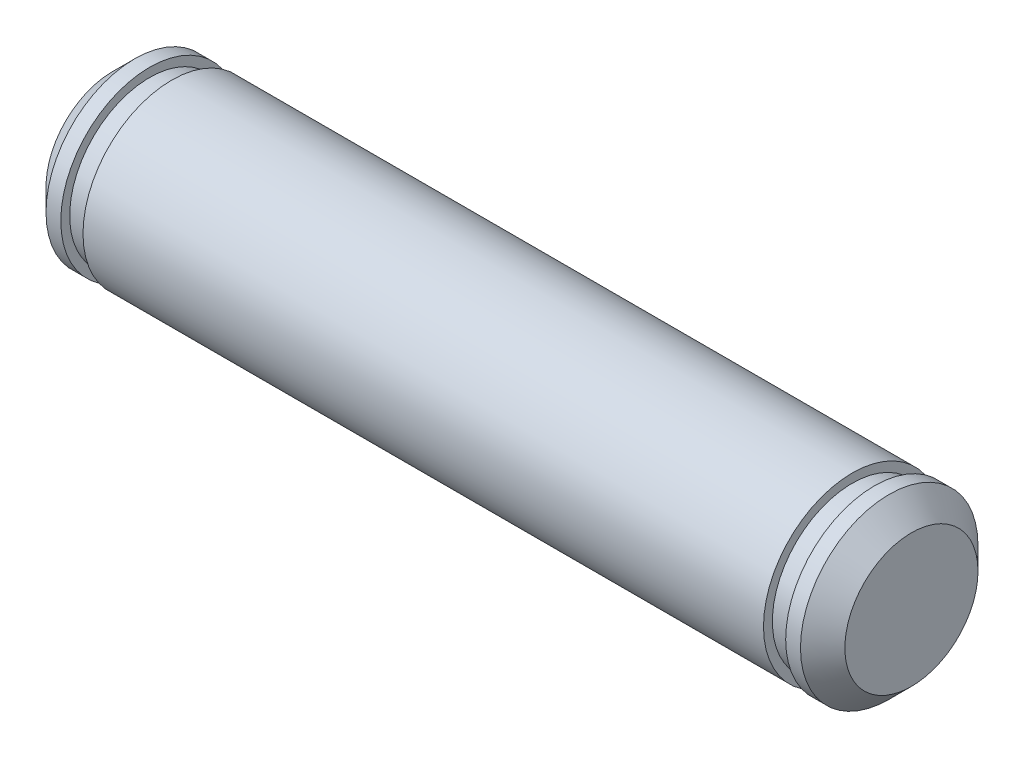
ISO-10303-21;
HEADER;
FILE_DESCRIPTION(('STEP AP214'),'2;1');
FILE_NAME('part.step','',(''),(''),'','','');
FILE_SCHEMA(('AUTOMOTIVE_DESIGN { 1 0 10303 214 1 1 1 1 }'));
ENDSEC;
DATA;
#1=APPLICATION_CONTEXT('core data for automotive mechanical design processes');
#2=APPLICATION_PROTOCOL_DEFINITION('international standard','automotive_design',2000,#1);
#3=PRODUCT_CONTEXT('',#1,'mechanical');
#4=PRODUCT('Part','Part','',(#3));
#5=PRODUCT_RELATED_PRODUCT_CATEGORY('part','',(#4));
#6=PRODUCT_DEFINITION_FORMATION('','',#4);
#7=PRODUCT_DEFINITION_CONTEXT('part definition',#1,'design');
#8=PRODUCT_DEFINITION('design','',#6,#7);
#9=PRODUCT_DEFINITION_SHAPE('','',#8);
#10=(LENGTH_UNIT() NAMED_UNIT(*) SI_UNIT(.MILLI.,.METRE.));
#11=(NAMED_UNIT(*) PLANE_ANGLE_UNIT() SI_UNIT($,.RADIAN.));
#12=(NAMED_UNIT(*) SI_UNIT($,.STERADIAN.) SOLID_ANGLE_UNIT());
#13=UNCERTAINTY_MEASURE_WITH_UNIT(LENGTH_MEASURE(1.E-05),#10,'distance_accuracy_value','');
#14=(GEOMETRIC_REPRESENTATION_CONTEXT(3) GLOBAL_UNCERTAINTY_ASSIGNED_CONTEXT((#13)) GLOBAL_UNIT_ASSIGNED_CONTEXT((#10,
#11,#12)) REPRESENTATION_CONTEXT('',''));
#15=CARTESIAN_POINT('',(0.,0.,0.));
#16=DIRECTION('',(0.,0.,1.));
#17=DIRECTION('',(1.,0.,0.));
#18=AXIS2_PLACEMENT_3D('',#15,#16,#17);
#19=CARTESIAN_POINT('',(13.5,0.,0.));
#20=DIRECTION('',(-1.,0.,0.));
#21=DIRECTION('',(0.,0.,1.));
#22=AXIS2_PLACEMENT_3D('',#19,#20,#21);
#23=CYLINDRICAL_SURFACE('',#22,3.);
#24=CARTESIAN_POINT('',(-11.5,0.,0.));
#25=DIRECTION('',(1.,0.,0.));
#26=DIRECTION('',(0.,0.,-1.));
#27=AXIS2_PLACEMENT_3D('',#24,#25,#26);
#28=CIRCLE('',#27,3.);
#29=CARTESIAN_POINT('',(-11.5,0.,-3.));
#30=VERTEX_POINT('',#29);
#31=EDGE_CURVE('E49',#30,#30,#28,.T.);
#32=ORIENTED_EDGE('',*,*,#31,.T.);
#33=EDGE_LOOP('',(#32));
#34=FACE_BOUND('',#33,.T.);
#35=CARTESIAN_POINT('',(11.5,0.,0.));
#36=DIRECTION('',(1.,0.,0.));
#37=DIRECTION('',(0.,0.,-1.));
#38=AXIS2_PLACEMENT_3D('',#35,#36,#37);
#39=CIRCLE('',#38,3.);
#40=CARTESIAN_POINT('',(11.5,0.,-3.));
#41=VERTEX_POINT('',#40);
#42=EDGE_CURVE('E48',#41,#41,#39,.T.);
#43=ORIENTED_EDGE('',*,*,#42,.F.);
#44=EDGE_LOOP('',(#43));
#45=FACE_BOUND('',#44,.T.);
#46=ADVANCED_FACE('F28',(#34,#45),#23,.T.);
#47=CARTESIAN_POINT('',(11.5,0.,0.));
#48=DIRECTION('',(1.,0.,0.));
#49=DIRECTION('',(0.,0.,-1.));
#50=AXIS2_PLACEMENT_3D('',#47,#48,#49);
#51=PLANE('',#50);
#52=CARTESIAN_POINT('',(11.5,0.,0.));
#53=DIRECTION('',(1.,0.,0.));
#54=DIRECTION('',(0.,0.,-1.));
#55=AXIS2_PLACEMENT_3D('',#52,#53,#54);
#56=CIRCLE('',#55,2.7);
#57=CARTESIAN_POINT('',(11.5,0.,-2.7));
#58=VERTEX_POINT('',#57);
#59=EDGE_CURVE('E62',#58,#58,#56,.T.);
#60=ORIENTED_EDGE('',*,*,#59,.F.);
#61=EDGE_LOOP('',(#60));
#62=FACE_BOUND('',#61,.T.);
#63=ORIENTED_EDGE('',*,*,#42,.T.);
#64=EDGE_LOOP('',(#63));
#65=FACE_BOUND('',#64,.T.);
#66=ADVANCED_FACE('F97',(#62,#65),#51,.T.);
#67=CARTESIAN_POINT('',(12.25,0.,0.));
#68=DIRECTION('',(1.,0.,0.));
#69=DIRECTION('',(0.,0.,-1.));
#70=AXIS2_PLACEMENT_3D('',#67,#68,#69);
#71=PLANE('',#70);
#72=CARTESIAN_POINT('',(12.25,0.,0.));
#73=DIRECTION('',(1.,0.,0.));
#74=DIRECTION('',(0.,0.,-1.));
#75=AXIS2_PLACEMENT_3D('',#72,#73,#74);
#76=CIRCLE('',#75,2.7);
#77=CARTESIAN_POINT('',(12.25,0.,-2.7));
#78=VERTEX_POINT('',#77);
#79=EDGE_CURVE('E52',#78,#78,#76,.T.);
#80=ORIENTED_EDGE('',*,*,#79,.T.);
#81=EDGE_LOOP('',(#80));
#82=FACE_BOUND('',#81,.T.);
#83=CARTESIAN_POINT('',(12.25,0.,0.));
#84=DIRECTION('',(1.,0.,0.));
#85=DIRECTION('',(0.,0.,-1.));
#86=AXIS2_PLACEMENT_3D('',#83,#84,#85);
#87=CIRCLE('',#86,3.);
#88=CARTESIAN_POINT('',(12.25,0.,-3.));
#89=VERTEX_POINT('',#88);
#90=EDGE_CURVE('E59',#89,#89,#87,.T.);
#91=ORIENTED_EDGE('',*,*,#90,.F.);
#92=EDGE_LOOP('',(#91));
#93=FACE_BOUND('',#92,.T.);
#94=ADVANCED_FACE('F111',(#82,#93),#71,.F.);
#95=CARTESIAN_POINT('',(11.5,0.,0.));
#96=DIRECTION('',(1.,0.,0.));
#97=DIRECTION('',(0.,0.,-1.));
#98=AXIS2_PLACEMENT_3D('',#95,#96,#97);
#99=CYLINDRICAL_SURFACE('',#98,2.7);
#100=ORIENTED_EDGE('',*,*,#59,.T.);
#101=EDGE_LOOP('',(#100));
#102=FACE_BOUND('',#101,.T.);
#103=ORIENTED_EDGE('',*,*,#79,.F.);
#104=EDGE_LOOP('',(#103));
#105=FACE_BOUND('',#104,.T.);
#106=ADVANCED_FACE('F107',(#102,#105),#99,.T.);
#107=CARTESIAN_POINT('',(13.5,0.,0.));
#108=DIRECTION('',(1.,0.,0.));
#109=DIRECTION('',(0.,0.,-1.));
#110=AXIS2_PLACEMENT_3D('',#107,#108,#109);
#111=PLANE('',#110);
#112=CARTESIAN_POINT('',(13.5,0.,0.));
#113=DIRECTION('',(1.,0.,0.));
#114=DIRECTION('',(0.,0.,-1.));
#115=AXIS2_PLACEMENT_3D('',#112,#113,#114);
#116=CIRCLE('',#115,2.24999999999999);
#117=CARTESIAN_POINT('',(13.5,0.,-2.24999999999999));
#118=VERTEX_POINT('',#117);
#119=EDGE_CURVE('E35',#118,#118,#116,.T.);
#120=ORIENTED_EDGE('',*,*,#119,.T.);
#121=EDGE_LOOP('',(#120));
#122=FACE_BOUND('',#121,.T.);
#123=ADVANCED_FACE('F100',(#122),#111,.T.);
#124=CARTESIAN_POINT('',(12.75,0.,0.));
#125=DIRECTION('',(1.,0.,0.));
#126=DIRECTION('',(0.,0.,-1.));
#127=AXIS2_PLACEMENT_3D('',#124,#125,#126);
#128=CIRCLE('',#127,3.);
#129=CARTESIAN_POINT('',(12.75,0.,-3.));
#130=VERTEX_POINT('',#129);
#131=EDGE_CURVE('E10',#130,#130,#128,.F.);
#132=ORIENTED_EDGE('',*,*,#131,.T.);
#133=EDGE_LOOP('',(#132));
#134=FACE_BOUND('',#133,.T.);
#135=ORIENTED_EDGE('',*,*,#90,.T.);
#136=EDGE_LOOP('',(#135));
#137=FACE_BOUND('',#136,.T.);
#138=ADVANCED_FACE('F30',(#134,#137),#23,.T.);
#139=CARTESIAN_POINT('',(-11.5,0.,0.));
#140=DIRECTION('',(1.,0.,0.));
#141=DIRECTION('',(0.,0.,-1.));
#142=AXIS2_PLACEMENT_3D('',#139,#140,#141);
#143=PLANE('',#142);
#144=CARTESIAN_POINT('',(-11.5,0.,0.));
#145=DIRECTION('',(1.,0.,0.));
#146=DIRECTION('',(0.,0.,-1.));
#147=AXIS2_PLACEMENT_3D('',#144,#145,#146);
#148=CIRCLE('',#147,2.7);
#149=CARTESIAN_POINT('',(-11.5,0.,-2.7));
#150=VERTEX_POINT('',#149);
#151=EDGE_CURVE('E56',#150,#150,#148,.T.);
#152=ORIENTED_EDGE('',*,*,#151,.T.);
#153=EDGE_LOOP('',(#152));
#154=FACE_BOUND('',#153,.T.);
#155=ORIENTED_EDGE('',*,*,#31,.F.);
#156=EDGE_LOOP('',(#155));
#157=FACE_BOUND('',#156,.T.);
#158=ADVANCED_FACE('F78',(#154,#157),#143,.F.);
#159=CARTESIAN_POINT('',(-12.25,0.,0.));
#160=DIRECTION('',(1.,0.,0.));
#161=DIRECTION('',(0.,0.,-1.));
#162=AXIS2_PLACEMENT_3D('',#159,#160,#161);
#163=PLANE('',#162);
#164=CARTESIAN_POINT('',(-12.25,0.,0.));
#165=DIRECTION('',(1.,0.,0.));
#166=DIRECTION('',(0.,0.,-1.));
#167=AXIS2_PLACEMENT_3D('',#164,#165,#166);
#168=CIRCLE('',#167,2.7);
#169=CARTESIAN_POINT('',(-12.25,0.,-2.7));
#170=VERTEX_POINT('',#169);
#171=EDGE_CURVE('E69',#170,#170,#168,.T.);
#172=ORIENTED_EDGE('',*,*,#171,.F.);
#173=EDGE_LOOP('',(#172));
#174=FACE_BOUND('',#173,.T.);
#175=CARTESIAN_POINT('',(-12.25,0.,0.));
#176=DIRECTION('',(1.,0.,0.));
#177=DIRECTION('',(0.,0.,-1.));
#178=AXIS2_PLACEMENT_3D('',#175,#176,#177);
#179=CIRCLE('',#178,3.);
#180=CARTESIAN_POINT('',(-12.25,0.,-3.));
#181=VERTEX_POINT('',#180);
#182=EDGE_CURVE('E53',#181,#181,#179,.T.);
#183=ORIENTED_EDGE('',*,*,#182,.T.);
#184=EDGE_LOOP('',(#183));
#185=FACE_BOUND('',#184,.T.);
#186=ADVANCED_FACE('F75',(#174,#185),#163,.T.);
#187=CARTESIAN_POINT('',(-11.5,0.,0.));
#188=DIRECTION('',(-1.,0.,0.));
#189=DIRECTION('',(0.,0.,1.));
#190=AXIS2_PLACEMENT_3D('',#187,#188,#189);
#191=CYLINDRICAL_SURFACE('',#190,2.7);
#192=ORIENTED_EDGE('',*,*,#151,.F.);
#193=EDGE_LOOP('',(#192));
#194=FACE_BOUND('',#193,.T.);
#195=ORIENTED_EDGE('',*,*,#171,.T.);
#196=EDGE_LOOP('',(#195));
#197=FACE_BOUND('',#196,.T.);
#198=ADVANCED_FACE('F73',(#194,#197),#191,.T.);
#199=CARTESIAN_POINT('',(-13.5,0.,0.));
#200=DIRECTION('',(1.,0.,0.));
#201=DIRECTION('',(0.,0.,-1.));
#202=AXIS2_PLACEMENT_3D('',#199,#200,#201);
#203=PLANE('',#202);
#204=CARTESIAN_POINT('',(-13.5,0.,0.));
#205=DIRECTION('',(1.,0.,0.));
#206=DIRECTION('',(0.,0.,-1.));
#207=AXIS2_PLACEMENT_3D('',#204,#205,#206);
#208=CIRCLE('',#207,2.24999999999999);
#209=CARTESIAN_POINT('',(-13.5,0.,-2.24999999999999));
#210=VERTEX_POINT('',#209);
#211=EDGE_CURVE('E39',#210,#210,#208,.F.);
#212=ORIENTED_EDGE('',*,*,#211,.T.);
#213=EDGE_LOOP('',(#212));
#214=FACE_BOUND('',#213,.T.);
#215=ADVANCED_FACE('F85',(#214),#203,.F.);
#216=CARTESIAN_POINT('',(-12.75,0.,0.));
#217=DIRECTION('',(1.,0.,0.));
#218=DIRECTION('',(0.,0.,-1.));
#219=AXIS2_PLACEMENT_3D('',#216,#217,#218);
#220=CIRCLE('',#219,3.);
#221=CARTESIAN_POINT('',(-12.75,0.,-3.));
#222=VERTEX_POINT('',#221);
#223=EDGE_CURVE('E43',#222,#222,#220,.T.);
#224=ORIENTED_EDGE('',*,*,#223,.T.);
#225=EDGE_LOOP('',(#224));
#226=FACE_BOUND('',#225,.T.);
#227=ORIENTED_EDGE('',*,*,#182,.F.);
#228=EDGE_LOOP('',(#227));
#229=FACE_BOUND('',#228,.T.);
#230=ADVANCED_FACE('F82',(#226,#229),#23,.T.);
#231=CARTESIAN_POINT('',(-12.75,0.,0.));
#232=DIRECTION('',(1.,0.,0.));
#233=DIRECTION('',(0.,0.,-1.));
#234=AXIS2_PLACEMENT_3D('',#231,#232,#233);
#235=CONICAL_SURFACE('',#234,3.,0.785398163397445);
#236=ORIENTED_EDGE('',*,*,#211,.F.);
#237=EDGE_LOOP('',(#236));
#238=FACE_BOUND('',#237,.T.);
#239=ORIENTED_EDGE('',*,*,#223,.F.);
#240=EDGE_LOOP('',(#239));
#241=FACE_BOUND('',#240,.T.);
#242=ADVANCED_FACE('F84',(#238,#241),#235,.T.);
#243=CARTESIAN_POINT('',(13.5,0.,0.));
#244=DIRECTION('',(-1.,0.,0.));
#245=DIRECTION('',(0.,0.,1.));
#246=AXIS2_PLACEMENT_3D('',#243,#244,#245);
#247=CONICAL_SURFACE('',#246,2.24999999999999,0.785398163397453);
#248=ORIENTED_EDGE('',*,*,#131,.F.);
#249=EDGE_LOOP('',(#248));
#250=FACE_BOUND('',#249,.T.);
#251=ORIENTED_EDGE('',*,*,#119,.F.);
#252=EDGE_LOOP('',(#251));
#253=FACE_BOUND('',#252,.T.);
#254=ADVANCED_FACE('F91',(#250,#253),#247,.T.);
#255=CLOSED_SHELL('',(#46,#66,#94,#106,#123,#138,#158,#186,#198,#215,#230,#242,#254));
#256=MANIFOLD_SOLID_BREP('B2',#255);
#257=ADVANCED_BREP_SHAPE_REPRESENTATION('',(#18,#256),#14);
#258=SHAPE_DEFINITION_REPRESENTATION(#9,#257);
ENDSEC;
END-ISO-10303-21;
